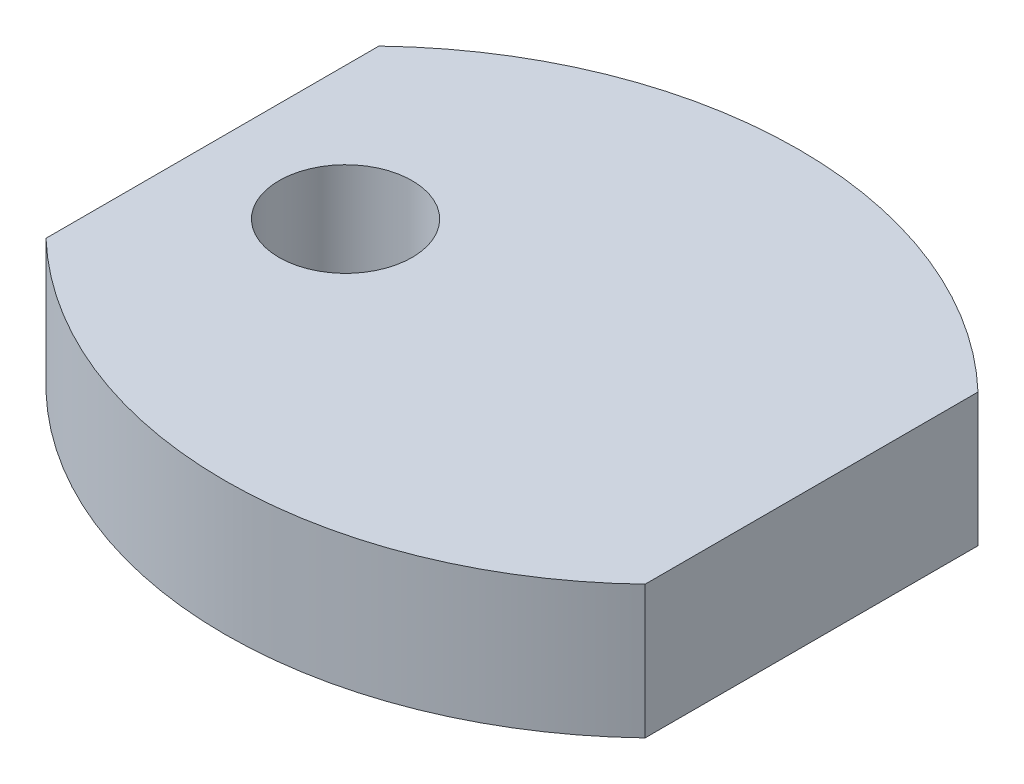
ISO-10303-21;
HEADER;
FILE_DESCRIPTION(('STEP AP214'),'2;1');
FILE_NAME('part.step','',(''),(''),'','','');
FILE_SCHEMA(('AUTOMOTIVE_DESIGN { 1 0 10303 214 1 1 1 1 }'));
ENDSEC;
DATA;
#1=APPLICATION_CONTEXT('core data for automotive mechanical design processes');
#2=APPLICATION_PROTOCOL_DEFINITION('international standard','automotive_design',2000,#1);
#3=PRODUCT_CONTEXT('',#1,'mechanical');
#4=PRODUCT('Part','Part','',(#3));
#5=PRODUCT_RELATED_PRODUCT_CATEGORY('part','',(#4));
#6=PRODUCT_DEFINITION_FORMATION('','',#4);
#7=PRODUCT_DEFINITION_CONTEXT('part definition',#1,'design');
#8=PRODUCT_DEFINITION('design','',#6,#7);
#9=PRODUCT_DEFINITION_SHAPE('','',#8);
#10=(LENGTH_UNIT() NAMED_UNIT(*) SI_UNIT(.MILLI.,.METRE.));
#11=(NAMED_UNIT(*) PLANE_ANGLE_UNIT() SI_UNIT($,.RADIAN.));
#12=(NAMED_UNIT(*) SI_UNIT($,.STERADIAN.) SOLID_ANGLE_UNIT());
#13=UNCERTAINTY_MEASURE_WITH_UNIT(LENGTH_MEASURE(1.E-05),#10,'distance_accuracy_value','');
#14=(GEOMETRIC_REPRESENTATION_CONTEXT(3) GLOBAL_UNCERTAINTY_ASSIGNED_CONTEXT((#13)) GLOBAL_UNIT_ASSIGNED_CONTEXT((#10,
#11,#12)) REPRESENTATION_CONTEXT('',''));
#15=CARTESIAN_POINT('',(0.,0.,0.));
#16=DIRECTION('',(0.,0.,1.));
#17=DIRECTION('',(1.,0.,0.));
#18=AXIS2_PLACEMENT_3D('',#15,#16,#17);
#19=CARTESIAN_POINT('',(0.,4.,4.38083151964686));
#20=DIRECTION('',(0.,1.,0.));
#21=DIRECTION('',(0.,0.,1.));
#22=AXIS2_PLACEMENT_3D('',#19,#20,#21);
#23=PLANE('',#22);
#24=CARTESIAN_POINT('',(0.,4.,4.38083151964686));
#25=DIRECTION('',(0.,1.,0.));
#26=DIRECTION('',(0.,0.,1.));
#27=AXIS2_PLACEMENT_3D('',#24,#25,#26);
#28=CIRCLE('',#27,13.);
#29=CARTESIAN_POINT('',(9.00000000000001,4.,-5.));
#30=VERTEX_POINT('',#29);
#31=CARTESIAN_POINT('',(-8.99999999999999,4.,-4.99999999999999));
#32=VERTEX_POINT('',#31);
#33=EDGE_CURVE('E87',#30,#32,#28,.T.);
#34=ORIENTED_EDGE('',*,*,#33,.T.);
#35=DIRECTION('',(0.,0.,1.));
#36=VECTOR('',#35,1.);
#37=CARTESIAN_POINT('',(-8.99999999999999,4.,4.99999999999999));
#38=LINE('',#37,#36);
#39=CARTESIAN_POINT('',(-8.99999999999999,4.,4.99999999999999));
#40=VERTEX_POINT('',#39);
#41=EDGE_CURVE('E82',#32,#40,#38,.T.);
#42=ORIENTED_EDGE('',*,*,#41,.T.);
#43=CARTESIAN_POINT('',(0.,4.,-4.38083151964686));
#44=DIRECTION('',(0.,1.,0.));
#45=DIRECTION('',(0.,0.,-1.));
#46=AXIS2_PLACEMENT_3D('',#43,#44,#45);
#47=CIRCLE('',#46,13.);
#48=CARTESIAN_POINT('',(9.00000000000001,4.,5.));
#49=VERTEX_POINT('',#48);
#50=EDGE_CURVE('E85',#40,#49,#47,.T.);
#51=ORIENTED_EDGE('',*,*,#50,.T.);
#52=DIRECTION('',(0.,0.,-1.));
#53=VECTOR('',#52,1.);
#54=CARTESIAN_POINT('',(9.00000000000001,4.,5.));
#55=LINE('',#54,#53);
#56=EDGE_CURVE('E52',#49,#30,#55,.T.);
#57=ORIENTED_EDGE('',*,*,#56,.T.);
#58=EDGE_LOOP('',(#34,#42,#51,#57));
#59=FACE_BOUND('',#58,.T.);
#60=CARTESIAN_POINT('',(-4.99999999999999,4.,0.));
#61=DIRECTION('',(0.,1.,0.));
#62=DIRECTION('',(0.,0.,1.));
#63=AXIS2_PLACEMENT_3D('',#60,#61,#62);
#64=CIRCLE('',#63,2.);
#65=CARTESIAN_POINT('',(-4.99999999999999,4.,2.));
#66=VERTEX_POINT('',#65);
#67=EDGE_CURVE('E102',#66,#66,#64,.T.);
#68=ORIENTED_EDGE('',*,*,#67,.F.);
#69=EDGE_LOOP('',(#68));
#70=FACE_BOUND('',#69,.T.);
#71=ADVANCED_FACE('F35',(#59,#70),#23,.T.);
#72=CARTESIAN_POINT('',(0.,0.,4.38083151964686));
#73=DIRECTION('',(0.,1.,0.));
#74=DIRECTION('',(0.,0.,1.));
#75=AXIS2_PLACEMENT_3D('',#72,#73,#74);
#76=PLANE('',#75);
#77=CARTESIAN_POINT('',(0.,0.,4.38083151964686));
#78=DIRECTION('',(0.,1.,0.));
#79=DIRECTION('',(0.,0.,1.));
#80=AXIS2_PLACEMENT_3D('',#77,#78,#79);
#81=CIRCLE('',#80,13.);
#82=CARTESIAN_POINT('',(9.00000000000001,0.,-5.));
#83=VERTEX_POINT('',#82);
#84=CARTESIAN_POINT('',(-8.99999999999999,0.,-4.99999999999999));
#85=VERTEX_POINT('',#84);
#86=EDGE_CURVE('E99',#83,#85,#81,.T.);
#87=ORIENTED_EDGE('',*,*,#86,.F.);
#88=DIRECTION('',(0.,0.,-1.));
#89=VECTOR('',#88,1.);
#90=CARTESIAN_POINT('',(9.00000000000001,0.,5.));
#91=LINE('',#90,#89);
#92=CARTESIAN_POINT('',(9.00000000000001,0.,5.));
#93=VERTEX_POINT('',#92);
#94=EDGE_CURVE('E75',#93,#83,#91,.T.);
#95=ORIENTED_EDGE('',*,*,#94,.F.);
#96=CARTESIAN_POINT('',(0.,0.,-4.38083151964686));
#97=DIRECTION('',(0.,1.,0.));
#98=DIRECTION('',(0.,0.,-1.));
#99=AXIS2_PLACEMENT_3D('',#96,#97,#98);
#100=CIRCLE('',#99,13.);
#101=CARTESIAN_POINT('',(-8.99999999999999,0.,4.99999999999999));
#102=VERTEX_POINT('',#101);
#103=EDGE_CURVE('E69',#102,#93,#100,.T.);
#104=ORIENTED_EDGE('',*,*,#103,.F.);
#105=DIRECTION('',(0.,0.,1.));
#106=VECTOR('',#105,1.);
#107=CARTESIAN_POINT('',(-8.99999999999999,0.,4.99999999999999));
#108=LINE('',#107,#106);
#109=EDGE_CURVE('E91',#85,#102,#108,.T.);
#110=ORIENTED_EDGE('',*,*,#109,.F.);
#111=EDGE_LOOP('',(#87,#95,#104,#110));
#112=FACE_BOUND('',#111,.T.);
#113=CARTESIAN_POINT('',(-4.99999999999999,0.,0.));
#114=DIRECTION('',(0.,1.,0.));
#115=DIRECTION('',(0.,0.,1.));
#116=AXIS2_PLACEMENT_3D('',#113,#114,#115);
#117=CIRCLE('',#116,2.);
#118=CARTESIAN_POINT('',(-4.99999999999999,0.,2.));
#119=VERTEX_POINT('',#118);
#120=EDGE_CURVE('E114',#119,#119,#117,.T.);
#121=ORIENTED_EDGE('',*,*,#120,.T.);
#122=EDGE_LOOP('',(#121));
#123=FACE_BOUND('',#122,.T.);
#124=ADVANCED_FACE('F110',(#112,#123),#76,.F.);
#125=CARTESIAN_POINT('',(0.,4.,4.38083151964686));
#126=DIRECTION('',(0.,-1.,0.));
#127=DIRECTION('',(0.,0.,-1.));
#128=AXIS2_PLACEMENT_3D('',#125,#126,#127);
#129=CYLINDRICAL_SURFACE('',#128,13.);
#130=ORIENTED_EDGE('',*,*,#86,.T.);
#131=DIRECTION('',(0.,-1.,0.));
#132=VECTOR('',#131,1.);
#133=CARTESIAN_POINT('',(-8.99999999999999,4.,-4.99999999999999));
#134=LINE('',#133,#132);
#135=EDGE_CURVE('E11',#32,#85,#134,.T.);
#136=ORIENTED_EDGE('',*,*,#135,.F.);
#137=ORIENTED_EDGE('',*,*,#33,.F.);
#138=DIRECTION('',(0.,-1.,0.));
#139=VECTOR('',#138,1.);
#140=CARTESIAN_POINT('',(9.00000000000001,4.,-5.));
#141=LINE('',#140,#139);
#142=EDGE_CURVE('E95',#30,#83,#141,.T.);
#143=ORIENTED_EDGE('',*,*,#142,.T.);
#144=EDGE_LOOP('',(#130,#136,#137,#143));
#145=FACE_BOUND('',#144,.T.);
#146=ADVANCED_FACE('F37',(#145),#129,.T.);
#147=CARTESIAN_POINT('',(-8.99999999999999,4.,4.99999999999999));
#148=DIRECTION('',(1.,0.,0.));
#149=DIRECTION('',(0.,0.,-1.));
#150=AXIS2_PLACEMENT_3D('',#147,#148,#149);
#151=PLANE('',#150);
#152=ORIENTED_EDGE('',*,*,#109,.T.);
#153=DIRECTION('',(0.,-1.,0.));
#154=VECTOR('',#153,1.);
#155=CARTESIAN_POINT('',(-8.99999999999999,4.,4.99999999999999));
#156=LINE('',#155,#154);
#157=EDGE_CURVE('E44',#40,#102,#156,.T.);
#158=ORIENTED_EDGE('',*,*,#157,.F.);
#159=ORIENTED_EDGE('',*,*,#41,.F.);
#160=ORIENTED_EDGE('',*,*,#135,.T.);
#161=EDGE_LOOP('',(#152,#158,#159,#160));
#162=FACE_BOUND('',#161,.T.);
#163=ADVANCED_FACE('F90',(#162),#151,.F.);
#164=CARTESIAN_POINT('',(0.,4.,-4.38083151964686));
#165=DIRECTION('',(0.,-1.,0.));
#166=DIRECTION('',(0.,0.,-1.));
#167=AXIS2_PLACEMENT_3D('',#164,#165,#166);
#168=CYLINDRICAL_SURFACE('',#167,13.);
#169=ORIENTED_EDGE('',*,*,#103,.T.);
#170=DIRECTION('',(0.,-1.,0.));
#171=VECTOR('',#170,1.);
#172=CARTESIAN_POINT('',(9.00000000000001,4.,5.));
#173=LINE('',#172,#171);
#174=EDGE_CURVE('E92',#49,#93,#173,.T.);
#175=ORIENTED_EDGE('',*,*,#174,.F.);
#176=ORIENTED_EDGE('',*,*,#50,.F.);
#177=ORIENTED_EDGE('',*,*,#157,.T.);
#178=EDGE_LOOP('',(#169,#175,#176,#177));
#179=FACE_BOUND('',#178,.T.);
#180=ADVANCED_FACE('F93',(#179),#168,.T.);
#181=CARTESIAN_POINT('',(9.00000000000001,4.,5.));
#182=DIRECTION('',(-1.,0.,0.));
#183=DIRECTION('',(0.,0.,1.));
#184=AXIS2_PLACEMENT_3D('',#181,#182,#183);
#185=PLANE('',#184);
#186=ORIENTED_EDGE('',*,*,#94,.T.);
#187=ORIENTED_EDGE('',*,*,#142,.F.);
#188=ORIENTED_EDGE('',*,*,#56,.F.);
#189=ORIENTED_EDGE('',*,*,#174,.T.);
#190=EDGE_LOOP('',(#186,#187,#188,#189));
#191=FACE_BOUND('',#190,.T.);
#192=ADVANCED_FACE('F107',(#191),#185,.F.);
#193=CARTESIAN_POINT('',(-4.99999999999999,4.,0.));
#194=DIRECTION('',(0.,-1.,0.));
#195=DIRECTION('',(0.,0.,-1.));
#196=AXIS2_PLACEMENT_3D('',#193,#194,#195);
#197=CYLINDRICAL_SURFACE('',#196,2.);
#198=ORIENTED_EDGE('',*,*,#67,.T.);
#199=EDGE_LOOP('',(#198));
#200=FACE_BOUND('',#199,.T.);
#201=ORIENTED_EDGE('',*,*,#120,.F.);
#202=EDGE_LOOP('',(#201));
#203=FACE_BOUND('',#202,.T.);
#204=ADVANCED_FACE('F120',(#200,#203),#197,.F.);
#205=CLOSED_SHELL('',(#71,#124,#146,#163,#180,#192,#204));
#206=MANIFOLD_SOLID_BREP('B2',#205);
#207=ADVANCED_BREP_SHAPE_REPRESENTATION('',(#18,#206),#14);
#208=SHAPE_DEFINITION_REPRESENTATION(#9,#207);
ENDSEC;
END-ISO-10303-21;
